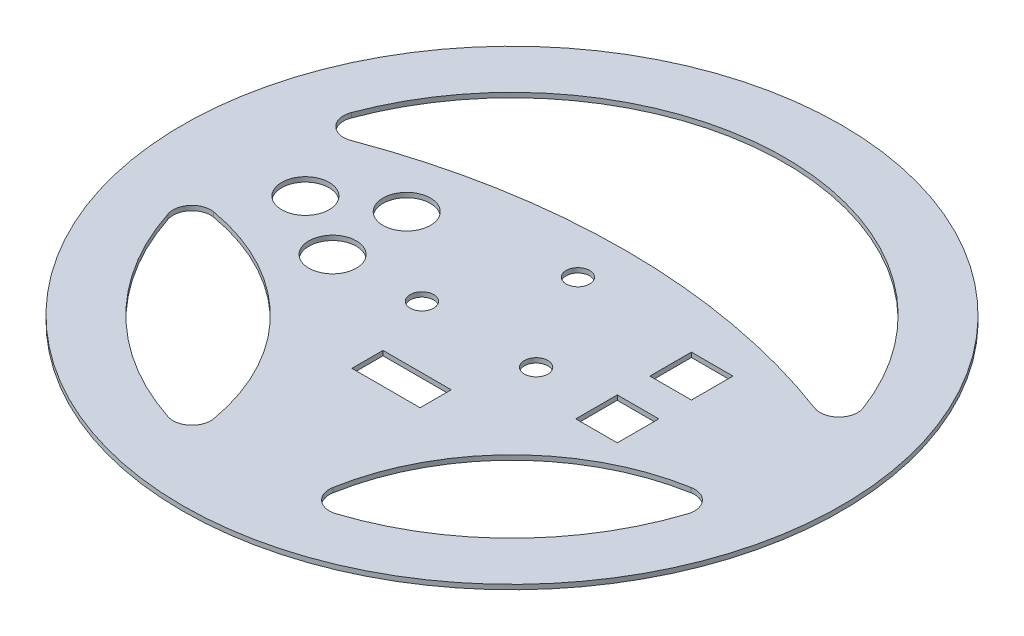
ISO-10303-21;
HEADER;
FILE_DESCRIPTION(('STEP AP214'),'2;1');
FILE_NAME('part.step','',(''),(''),'','','');
FILE_SCHEMA(('AUTOMOTIVE_DESIGN { 1 0 10303 214 1 1 1 1 }'));
ENDSEC;
DATA;
#1=APPLICATION_CONTEXT('core data for automotive mechanical design processes');
#2=APPLICATION_PROTOCOL_DEFINITION('international standard','automotive_design',2000,#1);
#3=PRODUCT_CONTEXT('',#1,'mechanical');
#4=PRODUCT('Part','Part','',(#3));
#5=PRODUCT_RELATED_PRODUCT_CATEGORY('part','',(#4));
#6=PRODUCT_DEFINITION_FORMATION('','',#4);
#7=PRODUCT_DEFINITION_CONTEXT('part definition',#1,'design');
#8=PRODUCT_DEFINITION('design','',#6,#7);
#9=PRODUCT_DEFINITION_SHAPE('','',#8);
#10=(LENGTH_UNIT() NAMED_UNIT(*) SI_UNIT(.MILLI.,.METRE.));
#11=(NAMED_UNIT(*) PLANE_ANGLE_UNIT() SI_UNIT($,.RADIAN.));
#12=(NAMED_UNIT(*) SI_UNIT($,.STERADIAN.) SOLID_ANGLE_UNIT());
#13=UNCERTAINTY_MEASURE_WITH_UNIT(LENGTH_MEASURE(1.E-05),#10,'distance_accuracy_value','');
#14=(GEOMETRIC_REPRESENTATION_CONTEXT(3) GLOBAL_UNCERTAINTY_ASSIGNED_CONTEXT((#13)) GLOBAL_UNIT_ASSIGNED_CONTEXT((#10,
#11,#12)) REPRESENTATION_CONTEXT('',''));
#15=CARTESIAN_POINT('',(0.,0.,0.));
#16=DIRECTION('',(0.,0.,1.));
#17=DIRECTION('',(1.,0.,0.));
#18=AXIS2_PLACEMENT_3D('',#15,#16,#17);
#19=CARTESIAN_POINT('',(0.,1.5875,0.));
#20=DIRECTION('',(0.,1.,0.));
#21=DIRECTION('',(0.,0.,1.));
#22=AXIS2_PLACEMENT_3D('',#19,#20,#21);
#23=PLANE('',#22);
#24=CARTESIAN_POINT('',(-69.650635094611,1.5875,0.));
#25=DIRECTION('',(0.,1.,0.));
#26=DIRECTION('',(0.,0.,-1.));
#27=AXIS2_PLACEMENT_3D('',#24,#25,#26);
#28=CIRCLE('',#27,7.99999999999999);
#29=CARTESIAN_POINT('',(-69.650635094611,1.5875,-7.99999999999999));
#30=VERTEX_POINT('',#29);
#31=EDGE_CURVE('E300',#30,#30,#28,.T.);
#32=ORIENTED_EDGE('',*,*,#31,.F.);
#33=EDGE_LOOP('',(#32));
#34=FACE_BOUND('',#33,.T.);
#35=DIRECTION('',(0.,0.,1.));
#36=VECTOR('',#35,1.);
#37=CARTESIAN_POINT('',(41.,1.5875,-19.5));
#38=LINE('',#37,#36);
#39=CARTESIAN_POINT('',(41.,1.5875,-19.5));
#40=VERTEX_POINT('',#39);
#41=CARTESIAN_POINT('',(41.,1.5875,-5.49999999999997));
#42=VERTEX_POINT('',#41);
#43=EDGE_CURVE('E319',#40,#42,#38,.T.);
#44=ORIENTED_EDGE('',*,*,#43,.F.);
#45=DIRECTION('',(-1.,0.,0.));
#46=VECTOR('',#45,1.);
#47=CARTESIAN_POINT('',(41.,1.5875,-19.5));
#48=LINE('',#47,#46);
#49=CARTESIAN_POINT('',(55.,1.5875,-19.5));
#50=VERTEX_POINT('',#49);
#51=EDGE_CURVE('E316',#50,#40,#48,.T.);
#52=ORIENTED_EDGE('',*,*,#51,.F.);
#53=DIRECTION('',(0.,0.,-1.));
#54=VECTOR('',#53,1.);
#55=CARTESIAN_POINT('',(55.,1.5875,-19.5));
#56=LINE('',#55,#54);
#57=CARTESIAN_POINT('',(55.,1.5875,-5.49999999999997));
#58=VERTEX_POINT('',#57);
#59=EDGE_CURVE('E327',#58,#50,#56,.T.);
#60=ORIENTED_EDGE('',*,*,#59,.F.);
#61=DIRECTION('',(1.,0.,0.));
#62=VECTOR('',#61,1.);
#63=CARTESIAN_POINT('',(41.,1.5875,-5.49999999999997));
#64=LINE('',#63,#62);
#65=EDGE_CURVE('E323',#42,#58,#64,.T.);
#66=ORIENTED_EDGE('',*,*,#65,.F.);
#67=EDGE_LOOP('',(#44,#52,#60,#66));
#68=FACE_BOUND('',#67,.T.);
#69=CARTESIAN_POINT('',(93.2576721688716,1.5875,93.2576721688716));
#70=DIRECTION('',(0.,1.,0.));
#71=DIRECTION('',(0.,0.,-1.));
#72=AXIS2_PLACEMENT_3D('',#69,#70,#71);
#73=CIRCLE('',#72,74.2755592000391);
#74=CARTESIAN_POINT('',(80.4847797094681,1.5875,20.0886082641104));
#75=VERTEX_POINT('',#74);
#76=CARTESIAN_POINT('',(20.0886082641104,1.5875,80.4847797094681));
#77=VERTEX_POINT('',#76);
#78=EDGE_CURVE('E362',#75,#77,#73,.T.);
#79=ORIENTED_EDGE('',*,*,#78,.F.);
#80=CARTESIAN_POINT('',(81.5767656600387,1.5875,26.3440112634188));
#81=DIRECTION('',(0.,1.,0.));
#82=DIRECTION('',(0.,0.,1.));
#83=AXIS2_PLACEMENT_3D('',#80,#81,#82);
#84=CIRCLE('',#83,6.35);
#85=CARTESIAN_POINT('',(87.6194890422637,1.5875,28.2954195051535));
#86=VERTEX_POINT('',#85);
#87=EDGE_CURVE('E359',#86,#75,#84,.T.);
#88=ORIENTED_EDGE('',*,*,#87,.F.);
#89=CARTESIAN_POINT('',(0.,1.5875,0.));
#90=DIRECTION('',(0.,1.,0.));
#91=DIRECTION('',(0.,0.,1.));
#92=AXIS2_PLACEMENT_3D('',#89,#90,#91);
#93=CIRCLE('',#92,92.075);
#94=CARTESIAN_POINT('',(28.2954195051535,1.5875,87.6194890422638));
#95=VERTEX_POINT('',#94);
#96=EDGE_CURVE('E370',#95,#86,#93,.T.);
#97=ORIENTED_EDGE('',*,*,#96,.F.);
#98=CARTESIAN_POINT('',(26.3440112634188,1.5875,81.5767656600387));
#99=DIRECTION('',(0.,1.,0.));
#100=DIRECTION('',(0.,0.,-1.));
#101=AXIS2_PLACEMENT_3D('',#98,#99,#100);
#102=CIRCLE('',#101,6.35);
#103=EDGE_CURVE('E366',#77,#95,#102,.T.);
#104=ORIENTED_EDGE('',*,*,#103,.F.);
#105=EDGE_LOOP('',(#79,#88,#97,#104));
#106=FACE_BOUND('',#105,.T.);
#107=CARTESIAN_POINT('',(0.,1.5875,0.));
#108=DIRECTION('',(0.,1.,0.));
#109=DIRECTION('',(0.,0.,1.));
#110=AXIS2_PLACEMENT_3D('',#107,#108,#109);
#111=CIRCLE('',#110,92.075);
#112=CARTESIAN_POINT('',(-87.6194890422638,1.5875,28.2954195051535));
#113=VERTEX_POINT('',#112);
#114=CARTESIAN_POINT('',(-28.2954195051536,1.5875,87.6194890422638));
#115=VERTEX_POINT('',#114);
#116=EDGE_CURVE('E405',#113,#115,#111,.T.);
#117=ORIENTED_EDGE('',*,*,#116,.F.);
#118=CARTESIAN_POINT('',(-81.5767656600387,1.5875,26.3440112634188));
#119=DIRECTION('',(0.,1.,0.));
#120=DIRECTION('',(0.,0.,1.));
#121=AXIS2_PLACEMENT_3D('',#118,#119,#120);
#122=CIRCLE('',#121,6.35000000000001);
#123=CARTESIAN_POINT('',(-80.4847797094681,1.5875,20.0886082641104));
#124=VERTEX_POINT('',#123);
#125=EDGE_CURVE('E402',#124,#113,#122,.T.);
#126=ORIENTED_EDGE('',*,*,#125,.F.);
#127=CARTESIAN_POINT('',(-93.2576721688716,1.5875,93.2576721688716));
#128=DIRECTION('',(0.,1.,0.));
#129=DIRECTION('',(0.,0.,-1.));
#130=AXIS2_PLACEMENT_3D('',#127,#128,#129);
#131=CIRCLE('',#130,74.2755592000391);
#132=CARTESIAN_POINT('',(-20.0886082641104,1.5875,80.4847797094681));
#133=VERTEX_POINT('',#132);
#134=EDGE_CURVE('E413',#133,#124,#131,.T.);
#135=ORIENTED_EDGE('',*,*,#134,.F.);
#136=CARTESIAN_POINT('',(-26.3440112634188,1.5875,81.5767656600387));
#137=DIRECTION('',(0.,1.,0.));
#138=DIRECTION('',(0.,0.,1.));
#139=AXIS2_PLACEMENT_3D('',#136,#137,#138);
#140=CIRCLE('',#139,6.35000000000001);
#141=EDGE_CURVE('E409',#115,#133,#140,.T.);
#142=ORIENTED_EDGE('',*,*,#141,.F.);
#143=EDGE_LOOP('',(#117,#126,#135,#142));
#144=FACE_BOUND('',#143,.T.);
#145=CARTESIAN_POINT('',(0.,1.5875,0.));
#146=DIRECTION('',(0.,1.,0.));
#147=DIRECTION('',(0.,0.,1.));
#148=AXIS2_PLACEMENT_3D('',#145,#146,#147);
#149=CIRCLE('',#148,92.075);
#150=CARTESIAN_POINT('',(86.2998340641457,1.5875,-32.0958605664488));
#151=VERTEX_POINT('',#150);
#152=CARTESIAN_POINT('',(-86.2998340641457,1.5875,-32.0958605664488));
#153=VERTEX_POINT('',#152);
#154=EDGE_CURVE('E448',#151,#153,#149,.T.);
#155=ORIENTED_EDGE('',*,*,#154,.F.);
#156=CARTESIAN_POINT('',(80.3481213700667,1.5875,-29.8823529411764));
#157=DIRECTION('',(0.,1.,0.));
#158=DIRECTION('',(0.,0.,-1.));
#159=AXIS2_PLACEMENT_3D('',#156,#157,#158);
#160=CIRCLE('',#159,6.34999999999999);
#161=CARTESIAN_POINT('',(78.1188093320533,1.5875,-23.9365419925195));
#162=VERTEX_POINT('',#161);
#163=EDGE_CURVE('E445',#162,#151,#160,.T.);
#164=ORIENTED_EDGE('',*,*,#163,.F.);
#165=CARTESIAN_POINT('',(0.,1.5875,184.414583333333));
#166=DIRECTION('',(0.,-1.,0.));
#167=DIRECTION('',(0.,0.,1.));
#168=AXIS2_PLACEMENT_3D('',#165,#166,#167);
#169=CIRCLE('',#168,222.514583333333);
#170=CARTESIAN_POINT('',(-78.1188093320533,1.5875,-23.9365419925195));
#171=VERTEX_POINT('',#170);
#172=EDGE_CURVE('E456',#171,#162,#169,.T.);
#173=ORIENTED_EDGE('',*,*,#172,.F.);
#174=CARTESIAN_POINT('',(-80.3481213700667,1.5875,-29.8823529411764));
#175=DIRECTION('',(0.,1.,0.));
#176=DIRECTION('',(0.,0.,-1.));
#177=AXIS2_PLACEMENT_3D('',#174,#175,#176);
#178=CIRCLE('',#177,6.34999999999999);
#179=EDGE_CURVE('E452',#153,#171,#178,.T.);
#180=ORIENTED_EDGE('',*,*,#179,.F.);
#181=EDGE_LOOP('',(#155,#164,#173,#180));
#182=FACE_BOUND('',#181,.T.);
#183=CARTESIAN_POINT('',(-19.2474145991077,1.5875,11.1125000000008));
#184=DIRECTION('',(0.,1.,0.));
#185=DIRECTION('',(0.,0.,1.));
#186=AXIS2_PLACEMENT_3D('',#183,#184,#185);
#187=CIRCLE('',#186,3.9687500000018);
#188=CARTESIAN_POINT('',(-19.2474145991077,1.5875,15.0812500000026));
#189=VERTEX_POINT('',#188);
#190=EDGE_CURVE('E488',#189,#189,#187,.T.);
#191=ORIENTED_EDGE('',*,*,#190,.F.);
#192=EDGE_LOOP('',(#191));
#193=FACE_BOUND('',#192,.T.);
#194=CARTESIAN_POINT('',(0.,1.5875,-22.225));
#195=DIRECTION('',(0.,1.,0.));
#196=DIRECTION('',(0.,0.,1.));
#197=AXIS2_PLACEMENT_3D('',#194,#195,#196);
#198=CIRCLE('',#197,3.96875);
#199=CARTESIAN_POINT('',(0.,1.5875,-18.25625));
#200=VERTEX_POINT('',#199);
#201=EDGE_CURVE('E504',#200,#200,#198,.T.);
#202=ORIENTED_EDGE('',*,*,#201,.F.);
#203=EDGE_LOOP('',(#202));
#204=FACE_BOUND('',#203,.T.);
#205=CARTESIAN_POINT('',(0.,1.5875,0.));
#206=DIRECTION('',(0.,1.,0.));
#207=DIRECTION('',(0.,0.,1.));
#208=AXIS2_PLACEMENT_3D('',#205,#206,#207);
#209=CIRCLE('',#208,111.125);
#210=CARTESIAN_POINT('',(0.,1.5875,111.125));
#211=VERTEX_POINT('',#210);
#212=EDGE_CURVE('E11',#211,#211,#209,.T.);
#213=ORIENTED_EDGE('',*,*,#212,.T.);
#214=EDGE_LOOP('',(#213));
#215=FACE_BOUND('',#214,.T.);
#216=CARTESIAN_POINT('',(19.2474145991106,1.5875,11.1124999999992));
#217=DIRECTION('',(0.,1.,0.));
#218=DIRECTION('',(0.,0.,1.));
#219=AXIS2_PLACEMENT_3D('',#216,#217,#218);
#220=CIRCLE('',#219,3.96875000000122);
#221=CARTESIAN_POINT('',(19.2474145991106,1.5875,15.0812500000004));
#222=VERTEX_POINT('',#221);
#223=EDGE_CURVE('E496',#222,#222,#220,.T.);
#224=ORIENTED_EDGE('',*,*,#223,.F.);
#225=EDGE_LOOP('',(#224));
#226=FACE_BOUND('',#225,.T.);
#227=CARTESIAN_POINT('',(-48.,1.5875,12.5));
#228=DIRECTION('',(0.,1.,0.));
#229=DIRECTION('',(0.,0.,-1.));
#230=AXIS2_PLACEMENT_3D('',#227,#228,#229);
#231=CIRCLE('',#230,8.);
#232=CARTESIAN_POINT('',(-48.,1.5875,4.5));
#233=VERTEX_POINT('',#232);
#234=EDGE_CURVE('E308',#233,#233,#231,.T.);
#235=ORIENTED_EDGE('',*,*,#234,.F.);
#236=EDGE_LOOP('',(#235));
#237=FACE_BOUND('',#236,.T.);
#238=CARTESIAN_POINT('',(-48.,1.5875,-12.5));
#239=DIRECTION('',(0.,1.,0.));
#240=DIRECTION('',(0.,0.,-1.));
#241=AXIS2_PLACEMENT_3D('',#238,#239,#240);
#242=CIRCLE('',#241,8.);
#243=CARTESIAN_POINT('',(-48.,1.5875,-20.5));
#244=VERTEX_POINT('',#243);
#245=EDGE_CURVE('E292',#244,#244,#242,.T.);
#246=ORIENTED_EDGE('',*,*,#245,.F.);
#247=EDGE_LOOP('',(#246));
#248=FACE_BOUND('',#247,.T.);
#249=DIRECTION('',(1.,0.,0.));
#250=VECTOR('',#249,1.);
#251=CARTESIAN_POINT('',(-11.5,1.5875,42.4964329284181));
#252=LINE('',#251,#250);
#253=CARTESIAN_POINT('',(-11.5,1.5875,42.4964329284181));
#254=VERTEX_POINT('',#253);
#255=CARTESIAN_POINT('',(11.5,1.5875,42.4964329284181));
#256=VERTEX_POINT('',#255);
#257=EDGE_CURVE('E252',#254,#256,#252,.T.);
#258=ORIENTED_EDGE('',*,*,#257,.F.);
#259=DIRECTION('',(0.,0.,1.));
#260=VECTOR('',#259,1.);
#261=CARTESIAN_POINT('',(-11.5,1.5875,42.4964329284181));
#262=LINE('',#261,#260);
#263=CARTESIAN_POINT('',(-11.5,1.5875,31.9964329284181));
#264=VERTEX_POINT('',#263);
#265=EDGE_CURVE('E249',#264,#254,#262,.T.);
#266=ORIENTED_EDGE('',*,*,#265,.F.);
#267=DIRECTION('',(-1.,0.,0.));
#268=VECTOR('',#267,1.);
#269=CARTESIAN_POINT('',(-11.5,1.5875,31.9964329284181));
#270=LINE('',#269,#268);
#271=CARTESIAN_POINT('',(11.5,1.5875,31.9964329284181));
#272=VERTEX_POINT('',#271);
#273=EDGE_CURVE('E260',#272,#264,#270,.T.);
#274=ORIENTED_EDGE('',*,*,#273,.F.);
#275=DIRECTION('',(0.,0.,-1.));
#276=VECTOR('',#275,1.);
#277=CARTESIAN_POINT('',(11.5,1.5875,42.4964329284181));
#278=LINE('',#277,#276);
#279=EDGE_CURVE('E256',#256,#272,#278,.T.);
#280=ORIENTED_EDGE('',*,*,#279,.F.);
#281=EDGE_LOOP('',(#258,#266,#274,#280));
#282=FACE_BOUND('',#281,.T.);
#283=DIRECTION('',(0.,0.,-1.));
#284=VECTOR('',#283,1.);
#285=CARTESIAN_POINT('',(55.,1.5875,19.5));
#286=LINE('',#285,#284);
#287=CARTESIAN_POINT('',(55.,1.5875,19.5));
#288=VERTEX_POINT('',#287);
#289=CARTESIAN_POINT('',(55.,1.5875,5.49999999999999));
#290=VERTEX_POINT('',#289);
#291=EDGE_CURVE('E210',#288,#290,#286,.T.);
#292=ORIENTED_EDGE('',*,*,#291,.F.);
#293=DIRECTION('',(1.,0.,0.));
#294=VECTOR('',#293,1.);
#295=CARTESIAN_POINT('',(41.,1.5875,19.5));
#296=LINE('',#295,#294);
#297=CARTESIAN_POINT('',(41.,1.5875,19.5));
#298=VERTEX_POINT('',#297);
#299=EDGE_CURVE('E201',#298,#288,#296,.T.);
#300=ORIENTED_EDGE('',*,*,#299,.F.);
#301=DIRECTION('',(0.,0.,1.));
#302=VECTOR('',#301,1.);
#303=CARTESIAN_POINT('',(41.,1.5875,19.5));
#304=LINE('',#303,#302);
#305=CARTESIAN_POINT('',(41.,1.5875,5.49999999999999));
#306=VERTEX_POINT('',#305);
#307=EDGE_CURVE('E227',#306,#298,#304,.T.);
#308=ORIENTED_EDGE('',*,*,#307,.F.);
#309=DIRECTION('',(-1.,0.,0.));
#310=VECTOR('',#309,1.);
#311=CARTESIAN_POINT('',(41.,1.5875,5.49999999999999));
#312=LINE('',#311,#310);
#313=EDGE_CURVE('E223',#290,#306,#312,.T.);
#314=ORIENTED_EDGE('',*,*,#313,.F.);
#315=EDGE_LOOP('',(#292,#300,#308,#314));
#316=FACE_BOUND('',#315,.T.);
#317=ADVANCED_FACE('F39',(#34,#68,#106,#144,#182,#193,#204,#215,#226,#237,#248,#282,#316),#23,.T.);
#318=CARTESIAN_POINT('',(0.,0.,0.));
#319=DIRECTION('',(0.,1.,0.));
#320=DIRECTION('',(0.,0.,1.));
#321=AXIS2_PLACEMENT_3D('',#318,#319,#320);
#322=PLANE('',#321);
#323=DIRECTION('',(0.,0.,1.));
#324=VECTOR('',#323,1.);
#325=CARTESIAN_POINT('',(-11.5,0.,42.4964329284181));
#326=LINE('',#325,#324);
#327=CARTESIAN_POINT('',(-11.5,0.,31.9964329284181));
#328=VERTEX_POINT('',#327);
#329=CARTESIAN_POINT('',(-11.5,0.,42.4964329284181));
#330=VERTEX_POINT('',#329);
#331=EDGE_CURVE('E219',#328,#330,#326,.T.);
#332=ORIENTED_EDGE('',*,*,#331,.T.);
#333=DIRECTION('',(1.,0.,0.));
#334=VECTOR('',#333,1.);
#335=CARTESIAN_POINT('',(-11.5,0.,42.4964329284181));
#336=LINE('',#335,#334);
#337=CARTESIAN_POINT('',(11.5,0.,42.4964329284181));
#338=VERTEX_POINT('',#337);
#339=EDGE_CURVE('E267',#330,#338,#336,.T.);
#340=ORIENTED_EDGE('',*,*,#339,.T.);
#341=DIRECTION('',(0.,0.,-1.));
#342=VECTOR('',#341,1.);
#343=CARTESIAN_POINT('',(11.5,0.,42.4964329284181));
#344=LINE('',#343,#342);
#345=CARTESIAN_POINT('',(11.5,0.,31.9964329284181));
#346=VERTEX_POINT('',#345);
#347=EDGE_CURVE('E271',#338,#346,#344,.T.);
#348=ORIENTED_EDGE('',*,*,#347,.T.);
#349=DIRECTION('',(-1.,0.,0.));
#350=VECTOR('',#349,1.);
#351=CARTESIAN_POINT('',(-11.5,0.,31.9964329284181));
#352=LINE('',#351,#350);
#353=EDGE_CURVE('E253',#346,#328,#352,.T.);
#354=ORIENTED_EDGE('',*,*,#353,.T.);
#355=EDGE_LOOP('',(#332,#340,#348,#354));
#356=FACE_BOUND('',#355,.T.);
#357=CARTESIAN_POINT('',(81.5767656600387,0.,26.3440112634188));
#358=DIRECTION('',(0.,1.,0.));
#359=DIRECTION('',(0.,0.,1.));
#360=AXIS2_PLACEMENT_3D('',#357,#358,#359);
#361=CIRCLE('',#360,6.35);
#362=CARTESIAN_POINT('',(87.6194890422638,0.,28.2954195051535));
#363=VERTEX_POINT('',#362);
#364=CARTESIAN_POINT('',(80.4847797094681,0.,20.0886082641104));
#365=VERTEX_POINT('',#364);
#366=EDGE_CURVE('E358',#363,#365,#361,.T.);
#367=ORIENTED_EDGE('',*,*,#366,.T.);
#368=CARTESIAN_POINT('',(93.2576721688716,0.,93.2576721688716));
#369=DIRECTION('',(0.,1.,0.));
#370=DIRECTION('',(0.,0.,-1.));
#371=AXIS2_PLACEMENT_3D('',#368,#369,#370);
#372=CIRCLE('',#371,74.2755592000391);
#373=CARTESIAN_POINT('',(20.0886082641104,0.,80.4847797094681));
#374=VERTEX_POINT('',#373);
#375=EDGE_CURVE('E377',#365,#374,#372,.T.);
#376=ORIENTED_EDGE('',*,*,#375,.T.);
#377=CARTESIAN_POINT('',(26.3440112634188,0.,81.5767656600387));
#378=DIRECTION('',(0.,1.,0.));
#379=DIRECTION('',(0.,0.,-1.));
#380=AXIS2_PLACEMENT_3D('',#377,#378,#379);
#381=CIRCLE('',#380,6.35);
#382=CARTESIAN_POINT('',(28.2954195051535,0.,87.6194890422637));
#383=VERTEX_POINT('',#382);
#384=EDGE_CURVE('E381',#374,#383,#381,.T.);
#385=ORIENTED_EDGE('',*,*,#384,.T.);
#386=CARTESIAN_POINT('',(0.,0.,0.));
#387=DIRECTION('',(0.,1.,0.));
#388=DIRECTION('',(0.,0.,1.));
#389=AXIS2_PLACEMENT_3D('',#386,#387,#388);
#390=CIRCLE('',#389,92.075);
#391=EDGE_CURVE('E363',#383,#363,#390,.T.);
#392=ORIENTED_EDGE('',*,*,#391,.T.);
#393=EDGE_LOOP('',(#367,#376,#385,#392));
#394=FACE_BOUND('',#393,.T.);
#395=CARTESIAN_POINT('',(80.3481213700667,0.,-29.8823529411764));
#396=DIRECTION('',(0.,1.,0.));
#397=DIRECTION('',(0.,0.,-1.));
#398=AXIS2_PLACEMENT_3D('',#395,#396,#397);
#399=CIRCLE('',#398,6.34999999999999);
#400=CARTESIAN_POINT('',(78.1188093320533,0.,-23.9365419925195));
#401=VERTEX_POINT('',#400);
#402=CARTESIAN_POINT('',(86.2998340641457,0.,-32.0958605664488));
#403=VERTEX_POINT('',#402);
#404=EDGE_CURVE('E444',#401,#403,#399,.T.);
#405=ORIENTED_EDGE('',*,*,#404,.T.);
#406=CARTESIAN_POINT('',(0.,0.,0.));
#407=DIRECTION('',(0.,1.,0.));
#408=DIRECTION('',(0.,0.,1.));
#409=AXIS2_PLACEMENT_3D('',#406,#407,#408);
#410=CIRCLE('',#409,92.075);
#411=CARTESIAN_POINT('',(-86.2998340641457,0.,-32.0958605664488));
#412=VERTEX_POINT('',#411);
#413=EDGE_CURVE('E463',#403,#412,#410,.T.);
#414=ORIENTED_EDGE('',*,*,#413,.T.);
#415=CARTESIAN_POINT('',(-80.3481213700667,0.,-29.8823529411764));
#416=DIRECTION('',(0.,1.,0.));
#417=DIRECTION('',(0.,0.,-1.));
#418=AXIS2_PLACEMENT_3D('',#415,#416,#417);
#419=CIRCLE('',#418,6.34999999999999);
#420=CARTESIAN_POINT('',(-78.1188093320533,0.,-23.9365419925195));
#421=VERTEX_POINT('',#420);
#422=EDGE_CURVE('E467',#412,#421,#419,.T.);
#423=ORIENTED_EDGE('',*,*,#422,.T.);
#424=CARTESIAN_POINT('',(0.,0.,184.414583333333));
#425=DIRECTION('',(0.,-1.,0.));
#426=DIRECTION('',(0.,0.,1.));
#427=AXIS2_PLACEMENT_3D('',#424,#425,#426);
#428=CIRCLE('',#427,222.514583333333);
#429=EDGE_CURVE('E449',#421,#401,#428,.T.);
#430=ORIENTED_EDGE('',*,*,#429,.T.);
#431=EDGE_LOOP('',(#405,#414,#423,#430));
#432=FACE_BOUND('',#431,.T.);
#433=CARTESIAN_POINT('',(0.,0.,0.));
#434=DIRECTION('',(0.,1.,0.));
#435=DIRECTION('',(0.,0.,1.));
#436=AXIS2_PLACEMENT_3D('',#433,#434,#435);
#437=CIRCLE('',#436,111.125);
#438=CARTESIAN_POINT('',(0.,0.,111.125));
#439=VERTEX_POINT('',#438);
#440=EDGE_CURVE('E43',#439,#439,#437,.T.);
#441=ORIENTED_EDGE('',*,*,#440,.F.);
#442=EDGE_LOOP('',(#441));
#443=FACE_BOUND('',#442,.T.);
#444=CARTESIAN_POINT('',(0.,0.,-22.225));
#445=DIRECTION('',(0.,1.,0.));
#446=DIRECTION('',(0.,0.,1.));
#447=AXIS2_PLACEMENT_3D('',#444,#445,#446);
#448=CIRCLE('',#447,3.96875);
#449=CARTESIAN_POINT('',(0.,0.,-18.25625));
#450=VERTEX_POINT('',#449);
#451=EDGE_CURVE('E500',#450,#450,#448,.T.);
#452=ORIENTED_EDGE('',*,*,#451,.T.);
#453=EDGE_LOOP('',(#452));
#454=FACE_BOUND('',#453,.T.);
#455=CARTESIAN_POINT('',(19.2474145991106,0.,11.1124999999992));
#456=DIRECTION('',(0.,1.,0.));
#457=DIRECTION('',(0.,0.,1.));
#458=AXIS2_PLACEMENT_3D('',#455,#456,#457);
#459=CIRCLE('',#458,3.96875000000122);
#460=CARTESIAN_POINT('',(19.2474145991106,0.,15.0812500000004));
#461=VERTEX_POINT('',#460);
#462=EDGE_CURVE('E492',#461,#461,#459,.T.);
#463=ORIENTED_EDGE('',*,*,#462,.T.);
#464=EDGE_LOOP('',(#463));
#465=FACE_BOUND('',#464,.T.);
#466=CARTESIAN_POINT('',(-19.2474145991077,0.,11.1125000000008));
#467=DIRECTION('',(0.,1.,0.));
#468=DIRECTION('',(0.,0.,1.));
#469=AXIS2_PLACEMENT_3D('',#466,#467,#468);
#470=CIRCLE('',#469,3.9687500000018);
#471=CARTESIAN_POINT('',(-19.2474145991077,0.,15.0812500000026));
#472=VERTEX_POINT('',#471);
#473=EDGE_CURVE('E487',#472,#472,#470,.T.);
#474=ORIENTED_EDGE('',*,*,#473,.T.);
#475=EDGE_LOOP('',(#474));
#476=FACE_BOUND('',#475,.T.);
#477=CARTESIAN_POINT('',(-81.5767656600387,0.,26.3440112634188));
#478=DIRECTION('',(0.,1.,0.));
#479=DIRECTION('',(0.,0.,1.));
#480=AXIS2_PLACEMENT_3D('',#477,#478,#479);
#481=CIRCLE('',#480,6.35000000000001);
#482=CARTESIAN_POINT('',(-80.4847797094681,0.,20.0886082641104));
#483=VERTEX_POINT('',#482);
#484=CARTESIAN_POINT('',(-87.6194890422638,0.,28.2954195051535));
#485=VERTEX_POINT('',#484);
#486=EDGE_CURVE('E401',#483,#485,#481,.T.);
#487=ORIENTED_EDGE('',*,*,#486,.T.);
#488=CARTESIAN_POINT('',(0.,0.,0.));
#489=DIRECTION('',(0.,1.,0.));
#490=DIRECTION('',(0.,0.,1.));
#491=AXIS2_PLACEMENT_3D('',#488,#489,#490);
#492=CIRCLE('',#491,92.075);
#493=CARTESIAN_POINT('',(-28.2954195051536,0.,87.6194890422638));
#494=VERTEX_POINT('',#493);
#495=EDGE_CURVE('E420',#485,#494,#492,.T.);
#496=ORIENTED_EDGE('',*,*,#495,.T.);
#497=CARTESIAN_POINT('',(-26.3440112634188,0.,81.5767656600387));
#498=DIRECTION('',(0.,1.,0.));
#499=DIRECTION('',(0.,0.,1.));
#500=AXIS2_PLACEMENT_3D('',#497,#498,#499);
#501=CIRCLE('',#500,6.35000000000001);
#502=CARTESIAN_POINT('',(-20.0886082641104,0.,80.4847797094681));
#503=VERTEX_POINT('',#502);
#504=EDGE_CURVE('E424',#494,#503,#501,.T.);
#505=ORIENTED_EDGE('',*,*,#504,.T.);
#506=CARTESIAN_POINT('',(-93.2576721688716,0.,93.2576721688716));
#507=DIRECTION('',(0.,1.,0.));
#508=DIRECTION('',(0.,0.,-1.));
#509=AXIS2_PLACEMENT_3D('',#506,#507,#508);
#510=CIRCLE('',#509,74.2755592000391);
#511=EDGE_CURVE('E406',#503,#483,#510,.T.);
#512=ORIENTED_EDGE('',*,*,#511,.T.);
#513=EDGE_LOOP('',(#487,#496,#505,#512));
#514=FACE_BOUND('',#513,.T.);
#515=DIRECTION('',(-1.,0.,0.));
#516=VECTOR('',#515,1.);
#517=CARTESIAN_POINT('',(41.,0.,-19.5));
#518=LINE('',#517,#516);
#519=CARTESIAN_POINT('',(55.,0.,-19.5));
#520=VERTEX_POINT('',#519);
#521=CARTESIAN_POINT('',(41.,0.,-19.5));
#522=VERTEX_POINT('',#521);
#523=EDGE_CURVE('E312',#520,#522,#518,.T.);
#524=ORIENTED_EDGE('',*,*,#523,.T.);
#525=DIRECTION('',(0.,0.,1.));
#526=VECTOR('',#525,1.);
#527=CARTESIAN_POINT('',(41.,0.,-19.5));
#528=LINE('',#527,#526);
#529=CARTESIAN_POINT('',(41.,0.,-5.49999999999997));
#530=VERTEX_POINT('',#529);
#531=EDGE_CURVE('E334',#522,#530,#528,.T.);
#532=ORIENTED_EDGE('',*,*,#531,.T.);
#533=DIRECTION('',(1.,0.,0.));
#534=VECTOR('',#533,1.);
#535=CARTESIAN_POINT('',(41.,0.,-5.49999999999997));
#536=LINE('',#535,#534);
#537=CARTESIAN_POINT('',(55.,0.,-5.49999999999997));
#538=VERTEX_POINT('',#537);
#539=EDGE_CURVE('E338',#530,#538,#536,.T.);
#540=ORIENTED_EDGE('',*,*,#539,.T.);
#541=DIRECTION('',(0.,0.,-1.));
#542=VECTOR('',#541,1.);
#543=CARTESIAN_POINT('',(55.,0.,-19.5));
#544=LINE('',#543,#542);
#545=EDGE_CURVE('E320',#538,#520,#544,.T.);
#546=ORIENTED_EDGE('',*,*,#545,.T.);
#547=EDGE_LOOP('',(#524,#532,#540,#546));
#548=FACE_BOUND('',#547,.T.);
#549=CARTESIAN_POINT('',(-48.,0.,12.5));
#550=DIRECTION('',(0.,1.,0.));
#551=DIRECTION('',(0.,0.,-1.));
#552=AXIS2_PLACEMENT_3D('',#549,#550,#551);
#553=CIRCLE('',#552,8.);
#554=CARTESIAN_POINT('',(-48.,0.,4.5));
#555=VERTEX_POINT('',#554);
#556=EDGE_CURVE('E304',#555,#555,#553,.T.);
#557=ORIENTED_EDGE('',*,*,#556,.T.);
#558=EDGE_LOOP('',(#557));
#559=FACE_BOUND('',#558,.T.);
#560=CARTESIAN_POINT('',(-69.650635094611,0.,0.));
#561=DIRECTION('',(0.,1.,0.));
#562=DIRECTION('',(0.,0.,-1.));
#563=AXIS2_PLACEMENT_3D('',#560,#561,#562);
#564=CIRCLE('',#563,7.99999999999999);
#565=CARTESIAN_POINT('',(-69.650635094611,0.,-7.99999999999999));
#566=VERTEX_POINT('',#565);
#567=EDGE_CURVE('E296',#566,#566,#564,.T.);
#568=ORIENTED_EDGE('',*,*,#567,.T.);
#569=EDGE_LOOP('',(#568));
#570=FACE_BOUND('',#569,.T.);
#571=CARTESIAN_POINT('',(-48.,0.,-12.5));
#572=DIRECTION('',(0.,1.,0.));
#573=DIRECTION('',(0.,0.,-1.));
#574=AXIS2_PLACEMENT_3D('',#571,#572,#573);
#575=CIRCLE('',#574,8.);
#576=CARTESIAN_POINT('',(-48.,0.,-20.5));
#577=VERTEX_POINT('',#576);
#578=EDGE_CURVE('E291',#577,#577,#575,.T.);
#579=ORIENTED_EDGE('',*,*,#578,.T.);
#580=EDGE_LOOP('',(#579));
#581=FACE_BOUND('',#580,.T.);
#582=DIRECTION('',(1.,0.,0.));
#583=VECTOR('',#582,1.);
#584=CARTESIAN_POINT('',(41.,0.,19.5));
#585=LINE('',#584,#583);
#586=CARTESIAN_POINT('',(41.,0.,19.5));
#587=VERTEX_POINT('',#586);
#588=CARTESIAN_POINT('',(55.,0.,19.5));
#589=VERTEX_POINT('',#588);
#590=EDGE_CURVE('E63',#587,#589,#585,.T.);
#591=ORIENTED_EDGE('',*,*,#590,.T.);
#592=DIRECTION('',(0.,0.,-1.));
#593=VECTOR('',#592,1.);
#594=CARTESIAN_POINT('',(55.,0.,19.5));
#595=LINE('',#594,#593);
#596=CARTESIAN_POINT('',(55.,0.,5.49999999999999));
#597=VERTEX_POINT('',#596);
#598=EDGE_CURVE('E217',#589,#597,#595,.T.);
#599=ORIENTED_EDGE('',*,*,#598,.T.);
#600=DIRECTION('',(-1.,0.,0.));
#601=VECTOR('',#600,1.);
#602=CARTESIAN_POINT('',(41.,0.,5.49999999999999));
#603=LINE('',#602,#601);
#604=CARTESIAN_POINT('',(41.,0.,5.49999999999999));
#605=VERTEX_POINT('',#604);
#606=EDGE_CURVE('E236',#597,#605,#603,.T.);
#607=ORIENTED_EDGE('',*,*,#606,.T.);
#608=DIRECTION('',(0.,0.,1.));
#609=VECTOR('',#608,1.);
#610=CARTESIAN_POINT('',(41.,0.,19.5));
#611=LINE('',#610,#609);
#612=EDGE_CURVE('E211',#605,#587,#611,.T.);
#613=ORIENTED_EDGE('',*,*,#612,.T.);
#614=EDGE_LOOP('',(#591,#599,#607,#613));
#615=FACE_BOUND('',#614,.T.);
#616=ADVANCED_FACE('F512',(#356,#394,#432,#443,#454,#465,#476,#514,#548,#559,#570,#581,#615),
#322,.F.);
#617=CARTESIAN_POINT('',(0.,1.5875,0.));
#618=DIRECTION('',(0.,-1.,0.));
#619=DIRECTION('',(0.,0.,-1.));
#620=AXIS2_PLACEMENT_3D('',#617,#618,#619);
#621=CYLINDRICAL_SURFACE('',#620,111.125);
#622=ORIENTED_EDGE('',*,*,#212,.F.);
#623=EDGE_LOOP('',(#622));
#624=FACE_BOUND('',#623,.T.);
#625=ORIENTED_EDGE('',*,*,#440,.T.);
#626=EDGE_LOOP('',(#625));
#627=FACE_BOUND('',#626,.T.);
#628=ADVANCED_FACE('F41',(#624,#627),#621,.T.);
#629=CARTESIAN_POINT('',(0.,1.5875,-22.225));
#630=DIRECTION('',(0.,-1.,0.));
#631=DIRECTION('',(0.,0.,-1.));
#632=AXIS2_PLACEMENT_3D('',#629,#630,#631);
#633=CYLINDRICAL_SURFACE('',#632,3.96875);
#634=ORIENTED_EDGE('',*,*,#201,.T.);
#635=EDGE_LOOP('',(#634));
#636=FACE_BOUND('',#635,.T.);
#637=ORIENTED_EDGE('',*,*,#451,.F.);
#638=EDGE_LOOP('',(#637));
#639=FACE_BOUND('',#638,.T.);
#640=ADVANCED_FACE('F515',(#636,#639),#633,.F.);
#641=CARTESIAN_POINT('',(19.2474145991106,1.5875,11.1124999999992));
#642=DIRECTION('',(0.,-1.,0.));
#643=DIRECTION('',(0.,0.,-1.));
#644=AXIS2_PLACEMENT_3D('',#641,#642,#643);
#645=CYLINDRICAL_SURFACE('',#644,3.96875000000122);
#646=ORIENTED_EDGE('',*,*,#223,.T.);
#647=EDGE_LOOP('',(#646));
#648=FACE_BOUND('',#647,.T.);
#649=ORIENTED_EDGE('',*,*,#462,.F.);
#650=EDGE_LOOP('',(#649));
#651=FACE_BOUND('',#650,.T.);
#652=ADVANCED_FACE('F517',(#648,#651),#645,.F.);
#653=CARTESIAN_POINT('',(-19.2474145991077,1.5875,11.1125000000008));
#654=DIRECTION('',(0.,-1.,0.));
#655=DIRECTION('',(0.,0.,-1.));
#656=AXIS2_PLACEMENT_3D('',#653,#654,#655);
#657=CYLINDRICAL_SURFACE('',#656,3.9687500000018);
#658=ORIENTED_EDGE('',*,*,#190,.T.);
#659=EDGE_LOOP('',(#658));
#660=FACE_BOUND('',#659,.T.);
#661=ORIENTED_EDGE('',*,*,#473,.F.);
#662=EDGE_LOOP('',(#661));
#663=FACE_BOUND('',#662,.T.);
#664=ADVANCED_FACE('F524',(#660,#663),#657,.F.);
#665=CARTESIAN_POINT('',(80.3481213700667,1.5875,-29.8823529411764));
#666=DIRECTION('',(0.,-1.,0.));
#667=DIRECTION('',(0.,0.,-1.));
#668=AXIS2_PLACEMENT_3D('',#665,#666,#667);
#669=CYLINDRICAL_SURFACE('',#668,6.34999999999999);
#670=ORIENTED_EDGE('',*,*,#404,.F.);
#671=DIRECTION('',(0.,-1.,0.));
#672=VECTOR('',#671,1.);
#673=CARTESIAN_POINT('',(78.1188093320533,1.5875,-23.9365419925195));
#674=LINE('',#673,#672);
#675=EDGE_CURVE('E459',#162,#401,#674,.T.);
#676=ORIENTED_EDGE('',*,*,#675,.F.);
#677=ORIENTED_EDGE('',*,*,#163,.T.);
#678=DIRECTION('',(0.,-1.,0.));
#679=VECTOR('',#678,1.);
#680=CARTESIAN_POINT('',(86.2998340641457,1.5875,-32.0958605664488));
#681=LINE('',#680,#679);
#682=EDGE_CURVE('E483',#151,#403,#681,.T.);
#683=ORIENTED_EDGE('',*,*,#682,.T.);
#684=EDGE_LOOP('',(#670,#676,#677,#683));
#685=FACE_BOUND('',#684,.T.);
#686=ADVANCED_FACE('F668',(#685),#669,.F.);
#687=CARTESIAN_POINT('',(0.,1.5875,0.));
#688=DIRECTION('',(0.,-1.,0.));
#689=DIRECTION('',(0.,0.,-1.));
#690=AXIS2_PLACEMENT_3D('',#687,#688,#689);
#691=CYLINDRICAL_SURFACE('',#690,92.075);
#692=ORIENTED_EDGE('',*,*,#413,.F.);
#693=ORIENTED_EDGE('',*,*,#682,.F.);
#694=ORIENTED_EDGE('',*,*,#154,.T.);
#695=DIRECTION('',(0.,-1.,0.));
#696=VECTOR('',#695,1.);
#697=CARTESIAN_POINT('',(-86.2998340641457,1.5875,-32.0958605664488));
#698=LINE('',#697,#696);
#699=EDGE_CURVE('E480',#153,#412,#698,.T.);
#700=ORIENTED_EDGE('',*,*,#699,.T.);
#701=EDGE_LOOP('',(#692,#693,#694,#700));
#702=FACE_BOUND('',#701,.T.);
#703=ADVANCED_FACE('F664',(#702),#691,.F.);
#704=CARTESIAN_POINT('',(-80.3481213700667,1.5875,-29.8823529411764));
#705=DIRECTION('',(0.,-1.,0.));
#706=DIRECTION('',(0.,0.,-1.));
#707=AXIS2_PLACEMENT_3D('',#704,#705,#706);
#708=CYLINDRICAL_SURFACE('',#707,6.34999999999999);
#709=ORIENTED_EDGE('',*,*,#422,.F.);
#710=ORIENTED_EDGE('',*,*,#699,.F.);
#711=ORIENTED_EDGE('',*,*,#179,.T.);
#712=DIRECTION('',(0.,-1.,0.));
#713=VECTOR('',#712,1.);
#714=CARTESIAN_POINT('',(-78.1188093320533,1.5875,-23.9365419925195));
#715=LINE('',#714,#713);
#716=EDGE_CURVE('E477',#171,#421,#715,.T.);
#717=ORIENTED_EDGE('',*,*,#716,.T.);
#718=EDGE_LOOP('',(#709,#710,#711,#717));
#719=FACE_BOUND('',#718,.T.);
#720=ADVANCED_FACE('F660',(#719),#708,.F.);
#721=CARTESIAN_POINT('',(0.,1.5875,184.414583333333));
#722=DIRECTION('',(0.,-1.,0.));
#723=DIRECTION('',(0.,0.,-1.));
#724=AXIS2_PLACEMENT_3D('',#721,#722,#723);
#725=CYLINDRICAL_SURFACE('',#724,222.514583333333);
#726=ORIENTED_EDGE('',*,*,#429,.F.);
#727=ORIENTED_EDGE('',*,*,#716,.F.);
#728=ORIENTED_EDGE('',*,*,#172,.T.);
#729=ORIENTED_EDGE('',*,*,#675,.T.);
#730=EDGE_LOOP('',(#726,#727,#728,#729));
#731=FACE_BOUND('',#730,.T.);
#732=ADVANCED_FACE('F656',(#731),#725,.T.);
#733=CARTESIAN_POINT('',(-81.5767656600387,1.5875,26.3440112634188));
#734=DIRECTION('',(0.,-1.,0.));
#735=DIRECTION('',(0.,0.,-1.));
#736=AXIS2_PLACEMENT_3D('',#733,#734,#735);
#737=CYLINDRICAL_SURFACE('',#736,6.35000000000001);
#738=ORIENTED_EDGE('',*,*,#486,.F.);
#739=DIRECTION('',(0.,-1.,0.));
#740=VECTOR('',#739,1.);
#741=CARTESIAN_POINT('',(-80.4847797094681,1.5875,20.0886082641104));
#742=LINE('',#741,#740);
#743=EDGE_CURVE('E416',#124,#483,#742,.T.);
#744=ORIENTED_EDGE('',*,*,#743,.F.);
#745=ORIENTED_EDGE('',*,*,#125,.T.);
#746=DIRECTION('',(0.,-1.,0.));
#747=VECTOR('',#746,1.);
#748=CARTESIAN_POINT('',(-87.6194890422638,1.5875,28.2954195051535));
#749=LINE('',#748,#747);
#750=EDGE_CURVE('E440',#113,#485,#749,.T.);
#751=ORIENTED_EDGE('',*,*,#750,.T.);
#752=EDGE_LOOP('',(#738,#744,#745,#751));
#753=FACE_BOUND('',#752,.T.);
#754=ADVANCED_FACE('F652',(#753),#737,.F.);
#755=CARTESIAN_POINT('',(0.,1.5875,0.));
#756=DIRECTION('',(0.,-1.,0.));
#757=DIRECTION('',(0.,0.,-1.));
#758=AXIS2_PLACEMENT_3D('',#755,#756,#757);
#759=CYLINDRICAL_SURFACE('',#758,92.075);
#760=ORIENTED_EDGE('',*,*,#495,.F.);
#761=ORIENTED_EDGE('',*,*,#750,.F.);
#762=ORIENTED_EDGE('',*,*,#116,.T.);
#763=DIRECTION('',(0.,-1.,0.));
#764=VECTOR('',#763,1.);
#765=CARTESIAN_POINT('',(-28.2954195051536,1.5875,87.6194890422638));
#766=LINE('',#765,#764);
#767=EDGE_CURVE('E437',#115,#494,#766,.T.);
#768=ORIENTED_EDGE('',*,*,#767,.T.);
#769=EDGE_LOOP('',(#760,#761,#762,#768));
#770=FACE_BOUND('',#769,.T.);
#771=ADVANCED_FACE('F648',(#770),#759,.F.);
#772=CARTESIAN_POINT('',(-26.3440112634188,1.5875,81.5767656600387));
#773=DIRECTION('',(0.,-1.,0.));
#774=DIRECTION('',(0.,0.,-1.));
#775=AXIS2_PLACEMENT_3D('',#772,#773,#774);
#776=CYLINDRICAL_SURFACE('',#775,6.35000000000001);
#777=ORIENTED_EDGE('',*,*,#504,.F.);
#778=ORIENTED_EDGE('',*,*,#767,.F.);
#779=ORIENTED_EDGE('',*,*,#141,.T.);
#780=DIRECTION('',(0.,-1.,0.));
#781=VECTOR('',#780,1.);
#782=CARTESIAN_POINT('',(-20.0886082641104,1.5875,80.4847797094681));
#783=LINE('',#782,#781);
#784=EDGE_CURVE('E434',#133,#503,#783,.T.);
#785=ORIENTED_EDGE('',*,*,#784,.T.);
#786=EDGE_LOOP('',(#777,#778,#779,#785));
#787=FACE_BOUND('',#786,.T.);
#788=ADVANCED_FACE('F644',(#787),#776,.F.);
#789=CARTESIAN_POINT('',(-93.2576721688716,1.5875,93.2576721688716));
#790=DIRECTION('',(0.,-1.,0.));
#791=DIRECTION('',(0.,0.,-1.));
#792=AXIS2_PLACEMENT_3D('',#789,#790,#791);
#793=CYLINDRICAL_SURFACE('',#792,74.2755592000391);
#794=ORIENTED_EDGE('',*,*,#511,.F.);
#795=ORIENTED_EDGE('',*,*,#784,.F.);
#796=ORIENTED_EDGE('',*,*,#134,.T.);
#797=ORIENTED_EDGE('',*,*,#743,.T.);
#798=EDGE_LOOP('',(#794,#795,#796,#797));
#799=FACE_BOUND('',#798,.T.);
#800=ADVANCED_FACE('F640',(#799),#793,.F.);
#801=CARTESIAN_POINT('',(81.5767656600387,1.5875,26.3440112634188));
#802=DIRECTION('',(0.,-1.,0.));
#803=DIRECTION('',(0.,0.,-1.));
#804=AXIS2_PLACEMENT_3D('',#801,#802,#803);
#805=CYLINDRICAL_SURFACE('',#804,6.35);
#806=ORIENTED_EDGE('',*,*,#366,.F.);
#807=DIRECTION('',(0.,-1.,0.));
#808=VECTOR('',#807,1.);
#809=CARTESIAN_POINT('',(87.6194890422637,1.5875,28.2954195051535));
#810=LINE('',#809,#808);
#811=EDGE_CURVE('E373',#86,#363,#810,.T.);
#812=ORIENTED_EDGE('',*,*,#811,.F.);
#813=ORIENTED_EDGE('',*,*,#87,.T.);
#814=DIRECTION('',(0.,-1.,0.));
#815=VECTOR('',#814,1.);
#816=CARTESIAN_POINT('',(80.4847797094681,1.5875,20.0886082641104));
#817=LINE('',#816,#815);
#818=EDGE_CURVE('E397',#75,#365,#817,.T.);
#819=ORIENTED_EDGE('',*,*,#818,.T.);
#820=EDGE_LOOP('',(#806,#812,#813,#819));
#821=FACE_BOUND('',#820,.T.);
#822=ADVANCED_FACE('F636',(#821),#805,.F.);
#823=CARTESIAN_POINT('',(93.2576721688716,1.5875,93.2576721688716));
#824=DIRECTION('',(0.,-1.,0.));
#825=DIRECTION('',(0.,0.,-1.));
#826=AXIS2_PLACEMENT_3D('',#823,#824,#825);
#827=CYLINDRICAL_SURFACE('',#826,74.2755592000391);
#828=ORIENTED_EDGE('',*,*,#375,.F.);
#829=ORIENTED_EDGE('',*,*,#818,.F.);
#830=ORIENTED_EDGE('',*,*,#78,.T.);
#831=DIRECTION('',(0.,-1.,0.));
#832=VECTOR('',#831,1.);
#833=CARTESIAN_POINT('',(20.0886082641104,1.5875,80.4847797094681));
#834=LINE('',#833,#832);
#835=EDGE_CURVE('E394',#77,#374,#834,.T.);
#836=ORIENTED_EDGE('',*,*,#835,.T.);
#837=EDGE_LOOP('',(#828,#829,#830,#836));
#838=FACE_BOUND('',#837,.T.);
#839=ADVANCED_FACE('F632',(#838),#827,.F.);
#840=CARTESIAN_POINT('',(26.3440112634188,1.5875,81.5767656600387));
#841=DIRECTION('',(0.,-1.,0.));
#842=DIRECTION('',(0.,0.,-1.));
#843=AXIS2_PLACEMENT_3D('',#840,#841,#842);
#844=CYLINDRICAL_SURFACE('',#843,6.35);
#845=ORIENTED_EDGE('',*,*,#384,.F.);
#846=ORIENTED_EDGE('',*,*,#835,.F.);
#847=ORIENTED_EDGE('',*,*,#103,.T.);
#848=DIRECTION('',(0.,-1.,0.));
#849=VECTOR('',#848,1.);
#850=CARTESIAN_POINT('',(28.2954195051535,1.5875,87.6194890422637));
#851=LINE('',#850,#849);
#852=EDGE_CURVE('E391',#95,#383,#851,.T.);
#853=ORIENTED_EDGE('',*,*,#852,.T.);
#854=EDGE_LOOP('',(#845,#846,#847,#853));
#855=FACE_BOUND('',#854,.T.);
#856=ADVANCED_FACE('F628',(#855),#844,.F.);
#857=CARTESIAN_POINT('',(0.,1.5875,0.));
#858=DIRECTION('',(0.,-1.,0.));
#859=DIRECTION('',(0.,0.,-1.));
#860=AXIS2_PLACEMENT_3D('',#857,#858,#859);
#861=CYLINDRICAL_SURFACE('',#860,92.075);
#862=ORIENTED_EDGE('',*,*,#391,.F.);
#863=ORIENTED_EDGE('',*,*,#852,.F.);
#864=ORIENTED_EDGE('',*,*,#96,.T.);
#865=ORIENTED_EDGE('',*,*,#811,.T.);
#866=EDGE_LOOP('',(#862,#863,#864,#865));
#867=FACE_BOUND('',#866,.T.);
#868=ADVANCED_FACE('F624',(#867),#861,.F.);
#869=CARTESIAN_POINT('',(41.,1.5875,-19.5));
#870=DIRECTION('',(0.,0.,1.));
#871=DIRECTION('',(1.,0.,0.));
#872=AXIS2_PLACEMENT_3D('',#869,#870,#871);
#873=PLANE('',#872);
#874=ORIENTED_EDGE('',*,*,#523,.F.);
#875=DIRECTION('',(0.,-1.,0.));
#876=VECTOR('',#875,1.);
#877=CARTESIAN_POINT('',(55.,1.5875,-19.5));
#878=LINE('',#877,#876);
#879=EDGE_CURVE('E330',#50,#520,#878,.T.);
#880=ORIENTED_EDGE('',*,*,#879,.F.);
#881=ORIENTED_EDGE('',*,*,#51,.T.);
#882=DIRECTION('',(0.,-1.,0.));
#883=VECTOR('',#882,1.);
#884=CARTESIAN_POINT('',(41.,1.5875,-19.5));
#885=LINE('',#884,#883);
#886=EDGE_CURVE('E354',#40,#522,#885,.T.);
#887=ORIENTED_EDGE('',*,*,#886,.T.);
#888=EDGE_LOOP('',(#874,#880,#881,#887));
#889=FACE_BOUND('',#888,.T.);
#890=ADVANCED_FACE('F620',(#889),#873,.T.);
#891=CARTESIAN_POINT('',(41.,1.5875,-19.5));
#892=DIRECTION('',(1.,0.,0.));
#893=DIRECTION('',(0.,0.,-1.));
#894=AXIS2_PLACEMENT_3D('',#891,#892,#893);
#895=PLANE('',#894);
#896=ORIENTED_EDGE('',*,*,#531,.F.);
#897=ORIENTED_EDGE('',*,*,#886,.F.);
#898=ORIENTED_EDGE('',*,*,#43,.T.);
#899=DIRECTION('',(0.,-1.,0.));
#900=VECTOR('',#899,1.);
#901=CARTESIAN_POINT('',(41.,1.5875,-5.49999999999997));
#902=LINE('',#901,#900);
#903=EDGE_CURVE('E351',#42,#530,#902,.T.);
#904=ORIENTED_EDGE('',*,*,#903,.T.);
#905=EDGE_LOOP('',(#896,#897,#898,#904));
#906=FACE_BOUND('',#905,.T.);
#907=ADVANCED_FACE('F616',(#906),#895,.T.);
#908=CARTESIAN_POINT('',(41.,1.5875,-5.49999999999997));
#909=DIRECTION('',(0.,0.,-1.));
#910=DIRECTION('',(-1.,0.,0.));
#911=AXIS2_PLACEMENT_3D('',#908,#909,#910);
#912=PLANE('',#911);
#913=ORIENTED_EDGE('',*,*,#539,.F.);
#914=ORIENTED_EDGE('',*,*,#903,.F.);
#915=ORIENTED_EDGE('',*,*,#65,.T.);
#916=DIRECTION('',(0.,-1.,0.));
#917=VECTOR('',#916,1.);
#918=CARTESIAN_POINT('',(55.,1.5875,-5.49999999999997));
#919=LINE('',#918,#917);
#920=EDGE_CURVE('E348',#58,#538,#919,.T.);
#921=ORIENTED_EDGE('',*,*,#920,.T.);
#922=EDGE_LOOP('',(#913,#914,#915,#921));
#923=FACE_BOUND('',#922,.T.);
#924=ADVANCED_FACE('F612',(#923),#912,.T.);
#925=CARTESIAN_POINT('',(55.,1.5875,-19.5));
#926=DIRECTION('',(-1.,0.,0.));
#927=DIRECTION('',(0.,0.,1.));
#928=AXIS2_PLACEMENT_3D('',#925,#926,#927);
#929=PLANE('',#928);
#930=ORIENTED_EDGE('',*,*,#545,.F.);
#931=ORIENTED_EDGE('',*,*,#920,.F.);
#932=ORIENTED_EDGE('',*,*,#59,.T.);
#933=ORIENTED_EDGE('',*,*,#879,.T.);
#934=EDGE_LOOP('',(#930,#931,#932,#933));
#935=FACE_BOUND('',#934,.T.);
#936=ADVANCED_FACE('F608',(#935),#929,.T.);
#937=CARTESIAN_POINT('',(-48.,1.5875,12.5));
#938=DIRECTION('',(0.,-1.,0.));
#939=DIRECTION('',(0.,0.,-1.));
#940=AXIS2_PLACEMENT_3D('',#937,#938,#939);
#941=CYLINDRICAL_SURFACE('',#940,8.);
#942=ORIENTED_EDGE('',*,*,#234,.T.);
#943=EDGE_LOOP('',(#942));
#944=FACE_BOUND('',#943,.T.);
#945=ORIENTED_EDGE('',*,*,#556,.F.);
#946=EDGE_LOOP('',(#945));
#947=FACE_BOUND('',#946,.T.);
#948=ADVANCED_FACE('F604',(#944,#947),#941,.F.);
#949=CARTESIAN_POINT('',(-69.650635094611,1.5875,0.));
#950=DIRECTION('',(0.,-1.,0.));
#951=DIRECTION('',(0.,0.,-1.));
#952=AXIS2_PLACEMENT_3D('',#949,#950,#951);
#953=CYLINDRICAL_SURFACE('',#952,7.99999999999999);
#954=ORIENTED_EDGE('',*,*,#31,.T.);
#955=EDGE_LOOP('',(#954));
#956=FACE_BOUND('',#955,.T.);
#957=ORIENTED_EDGE('',*,*,#567,.F.);
#958=EDGE_LOOP('',(#957));
#959=FACE_BOUND('',#958,.T.);
#960=ADVANCED_FACE('F600',(#956,#959),#953,.F.);
#961=CARTESIAN_POINT('',(-48.,1.5875,-12.5));
#962=DIRECTION('',(0.,-1.,0.));
#963=DIRECTION('',(0.,0.,-1.));
#964=AXIS2_PLACEMENT_3D('',#961,#962,#963);
#965=CYLINDRICAL_SURFACE('',#964,8.);
#966=ORIENTED_EDGE('',*,*,#245,.T.);
#967=EDGE_LOOP('',(#966));
#968=FACE_BOUND('',#967,.T.);
#969=ORIENTED_EDGE('',*,*,#578,.F.);
#970=EDGE_LOOP('',(#969));
#971=FACE_BOUND('',#970,.T.);
#972=ADVANCED_FACE('F597',(#968,#971),#965,.F.);
#973=CARTESIAN_POINT('',(-11.5,1.5875,42.4964329284181));
#974=DIRECTION('',(1.,0.,0.));
#975=DIRECTION('',(0.,0.,-1.));
#976=AXIS2_PLACEMENT_3D('',#973,#974,#975);
#977=PLANE('',#976);
#978=ORIENTED_EDGE('',*,*,#331,.F.);
#979=DIRECTION('',(0.,-1.,0.));
#980=VECTOR('',#979,1.);
#981=CARTESIAN_POINT('',(-11.5,1.5875,31.9964329284181));
#982=LINE('',#981,#980);
#983=EDGE_CURVE('E263',#264,#328,#982,.T.);
#984=ORIENTED_EDGE('',*,*,#983,.F.);
#985=ORIENTED_EDGE('',*,*,#265,.T.);
#986=DIRECTION('',(0.,-1.,0.));
#987=VECTOR('',#986,1.);
#988=CARTESIAN_POINT('',(-11.5,1.5875,42.4964329284181));
#989=LINE('',#988,#987);
#990=EDGE_CURVE('E287',#254,#330,#989,.T.);
#991=ORIENTED_EDGE('',*,*,#990,.T.);
#992=EDGE_LOOP('',(#978,#984,#985,#991));
#993=FACE_BOUND('',#992,.T.);
#994=ADVANCED_FACE('F579',(#993),#977,.T.);
#995=CARTESIAN_POINT('',(-11.5,1.5875,42.4964329284181));
#996=DIRECTION('',(0.,0.,-1.));
#997=DIRECTION('',(-1.,0.,0.));
#998=AXIS2_PLACEMENT_3D('',#995,#996,#997);
#999=PLANE('',#998);
#1000=ORIENTED_EDGE('',*,*,#339,.F.);
#1001=ORIENTED_EDGE('',*,*,#990,.F.);
#1002=ORIENTED_EDGE('',*,*,#257,.T.);
#1003=DIRECTION('',(0.,-1.,0.));
#1004=VECTOR('',#1003,1.);
#1005=CARTESIAN_POINT('',(11.5,1.5875,42.4964329284181));
#1006=LINE('',#1005,#1004);
#1007=EDGE_CURVE('E284',#256,#338,#1006,.T.);
#1008=ORIENTED_EDGE('',*,*,#1007,.T.);
#1009=EDGE_LOOP('',(#1000,#1001,#1002,#1008));
#1010=FACE_BOUND('',#1009,.T.);
#1011=ADVANCED_FACE('F572',(#1010),#999,.T.);
#1012=CARTESIAN_POINT('',(11.5,1.5875,42.4964329284181));
#1013=DIRECTION('',(-1.,0.,0.));
#1014=DIRECTION('',(0.,0.,1.));
#1015=AXIS2_PLACEMENT_3D('',#1012,#1013,#1014);
#1016=PLANE('',#1015);
#1017=ORIENTED_EDGE('',*,*,#347,.F.);
#1018=ORIENTED_EDGE('',*,*,#1007,.F.);
#1019=ORIENTED_EDGE('',*,*,#279,.T.);
#1020=DIRECTION('',(0.,-1.,0.));
#1021=VECTOR('',#1020,1.);
#1022=CARTESIAN_POINT('',(11.5,1.5875,31.9964329284181));
#1023=LINE('',#1022,#1021);
#1024=EDGE_CURVE('E281',#272,#346,#1023,.T.);
#1025=ORIENTED_EDGE('',*,*,#1024,.T.);
#1026=EDGE_LOOP('',(#1017,#1018,#1019,#1025));
#1027=FACE_BOUND('',#1026,.T.);
#1028=ADVANCED_FACE('F575',(#1027),#1016,.T.);
#1029=CARTESIAN_POINT('',(-11.5,1.5875,31.9964329284181));
#1030=DIRECTION('',(0.,0.,1.));
#1031=DIRECTION('',(1.,0.,0.));
#1032=AXIS2_PLACEMENT_3D('',#1029,#1030,#1031);
#1033=PLANE('',#1032);
#1034=ORIENTED_EDGE('',*,*,#353,.F.);
#1035=ORIENTED_EDGE('',*,*,#1024,.F.);
#1036=ORIENTED_EDGE('',*,*,#273,.T.);
#1037=ORIENTED_EDGE('',*,*,#983,.T.);
#1038=EDGE_LOOP('',(#1034,#1035,#1036,#1037));
#1039=FACE_BOUND('',#1038,.T.);
#1040=ADVANCED_FACE('F582',(#1039),#1033,.T.);
#1041=CARTESIAN_POINT('',(41.,1.5875,19.5));
#1042=DIRECTION('',(0.,0.,-1.));
#1043=DIRECTION('',(-1.,0.,0.));
#1044=AXIS2_PLACEMENT_3D('',#1041,#1042,#1043);
#1045=PLANE('',#1044);
#1046=ORIENTED_EDGE('',*,*,#590,.F.);
#1047=DIRECTION('',(0.,-1.,0.));
#1048=VECTOR('',#1047,1.);
#1049=CARTESIAN_POINT('',(41.,1.5875,19.5));
#1050=LINE('',#1049,#1048);
#1051=EDGE_CURVE('E205',#298,#587,#1050,.T.);
#1052=ORIENTED_EDGE('',*,*,#1051,.F.);
#1053=ORIENTED_EDGE('',*,*,#299,.T.);
#1054=DIRECTION('',(0.,-1.,0.));
#1055=VECTOR('',#1054,1.);
#1056=CARTESIAN_POINT('',(55.,1.5875,19.5));
#1057=LINE('',#1056,#1055);
#1058=EDGE_CURVE('E204',#288,#589,#1057,.T.);
#1059=ORIENTED_EDGE('',*,*,#1058,.T.);
#1060=EDGE_LOOP('',(#1046,#1052,#1053,#1059));
#1061=FACE_BOUND('',#1060,.T.);
#1062=ADVANCED_FACE('F203',(#1061),#1045,.T.);
#1063=CARTESIAN_POINT('',(55.,1.5875,19.5));
#1064=DIRECTION('',(-1.,0.,0.));
#1065=DIRECTION('',(0.,0.,1.));
#1066=AXIS2_PLACEMENT_3D('',#1063,#1064,#1065);
#1067=PLANE('',#1066);
#1068=ORIENTED_EDGE('',*,*,#598,.F.);
#1069=ORIENTED_EDGE('',*,*,#1058,.F.);
#1070=ORIENTED_EDGE('',*,*,#291,.T.);
#1071=DIRECTION('',(0.,-1.,0.));
#1072=VECTOR('',#1071,1.);
#1073=CARTESIAN_POINT('',(55.,1.5875,5.49999999999999));
#1074=LINE('',#1073,#1072);
#1075=EDGE_CURVE('E220',#290,#597,#1074,.T.);
#1076=ORIENTED_EDGE('',*,*,#1075,.T.);
#1077=EDGE_LOOP('',(#1068,#1069,#1070,#1076));
#1078=FACE_BOUND('',#1077,.T.);
#1079=ADVANCED_FACE('F214',(#1078),#1067,.T.);
#1080=CARTESIAN_POINT('',(41.,1.5875,5.49999999999999));
#1081=DIRECTION('',(0.,0.,1.));
#1082=DIRECTION('',(1.,0.,0.));
#1083=AXIS2_PLACEMENT_3D('',#1080,#1081,#1082);
#1084=PLANE('',#1083);
#1085=ORIENTED_EDGE('',*,*,#606,.F.);
#1086=ORIENTED_EDGE('',*,*,#1075,.F.);
#1087=ORIENTED_EDGE('',*,*,#313,.T.);
#1088=DIRECTION('',(0.,-1.,0.));
#1089=VECTOR('',#1088,1.);
#1090=CARTESIAN_POINT('',(41.,1.5875,5.49999999999999));
#1091=LINE('',#1090,#1089);
#1092=EDGE_CURVE('E55',#306,#605,#1091,.T.);
#1093=ORIENTED_EDGE('',*,*,#1092,.T.);
#1094=EDGE_LOOP('',(#1085,#1086,#1087,#1093));
#1095=FACE_BOUND('',#1094,.T.);
#1096=ADVANCED_FACE('F692',(#1095),#1084,.T.);
#1097=CARTESIAN_POINT('',(41.,1.5875,19.5));
#1098=DIRECTION('',(1.,0.,0.));
#1099=DIRECTION('',(0.,0.,-1.));
#1100=AXIS2_PLACEMENT_3D('',#1097,#1098,#1099);
#1101=PLANE('',#1100);
#1102=ORIENTED_EDGE('',*,*,#612,.F.);
#1103=ORIENTED_EDGE('',*,*,#1092,.F.);
#1104=ORIENTED_EDGE('',*,*,#307,.T.);
#1105=ORIENTED_EDGE('',*,*,#1051,.T.);
#1106=EDGE_LOOP('',(#1102,#1103,#1104,#1105));
#1107=FACE_BOUND('',#1106,.T.);
#1108=ADVANCED_FACE('F690',(#1107),#1101,.T.);
#1109=CLOSED_SHELL('',(#317,#616,#628,#640,#652,#664,#686,#703,#720,#732,#754,#771,#788,#800,
#822,#839,#856,#868,#890,#907,#924,#936,#948,#960,#972,#994,#1011,#1028,#1040,#1062,#1079,#1096,#1108));
#1110=MANIFOLD_SOLID_BREP('B2',#1109);
#1111=ADVANCED_BREP_SHAPE_REPRESENTATION('',(#18,#1110),#14);
#1112=SHAPE_DEFINITION_REPRESENTATION(#9,#1111);
ENDSEC;
END-ISO-10303-21;
